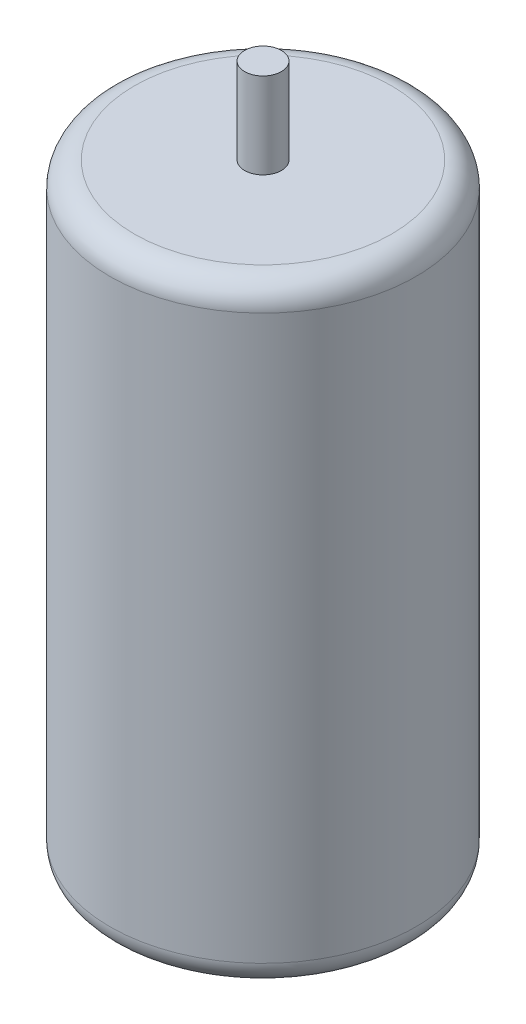
ISO-10303-21;
HEADER;
FILE_DESCRIPTION(('STEP AP214'),'2;1');
FILE_NAME('part.step','',(''),(''),'','','');
FILE_SCHEMA(('AUTOMOTIVE_DESIGN { 1 0 10303 214 1 1 1 1 }'));
ENDSEC;
DATA;
#1=APPLICATION_CONTEXT('core data for automotive mechanical design processes');
#2=APPLICATION_PROTOCOL_DEFINITION('international standard','automotive_design',2000,#1);
#3=PRODUCT_CONTEXT('',#1,'mechanical');
#4=PRODUCT('Part','Part','',(#3));
#5=PRODUCT_RELATED_PRODUCT_CATEGORY('part','',(#4));
#6=PRODUCT_DEFINITION_FORMATION('','',#4);
#7=PRODUCT_DEFINITION_CONTEXT('part definition',#1,'design');
#8=PRODUCT_DEFINITION('design','',#6,#7);
#9=PRODUCT_DEFINITION_SHAPE('','',#8);
#10=(LENGTH_UNIT() NAMED_UNIT(*) SI_UNIT(.MILLI.,.METRE.));
#11=(NAMED_UNIT(*) PLANE_ANGLE_UNIT() SI_UNIT($,.RADIAN.));
#12=(NAMED_UNIT(*) SI_UNIT($,.STERADIAN.) SOLID_ANGLE_UNIT());
#13=UNCERTAINTY_MEASURE_WITH_UNIT(LENGTH_MEASURE(1.E-05),#10,'distance_accuracy_value','');
#14=(GEOMETRIC_REPRESENTATION_CONTEXT(3) GLOBAL_UNCERTAINTY_ASSIGNED_CONTEXT((#13)) GLOBAL_UNIT_ASSIGNED_CONTEXT((#10,
#11,#12)) REPRESENTATION_CONTEXT('',''));
#15=CARTESIAN_POINT('',(0.,0.,0.));
#16=DIRECTION('',(0.,0.,1.));
#17=DIRECTION('',(1.,0.,0.));
#18=AXIS2_PLACEMENT_3D('',#15,#16,#17);
#19=CARTESIAN_POINT('',(0.,0.,0.));
#20=DIRECTION('',(0.,1.,0.));
#21=DIRECTION('',(0.,0.,1.));
#22=AXIS2_PLACEMENT_3D('',#19,#20,#21);
#23=PLANE('',#22);
#24=CARTESIAN_POINT('',(0.,0.,0.));
#25=DIRECTION('',(0.,1.,0.));
#26=DIRECTION('',(0.,0.,1.));
#27=AXIS2_PLACEMENT_3D('',#24,#25,#26);
#28=CIRCLE('',#27,10.5);
#29=CARTESIAN_POINT('',(0.,0.,10.5));
#30=VERTEX_POINT('',#29);
#31=EDGE_CURVE('E179',#30,#30,#28,.F.);
#32=ORIENTED_EDGE('',*,*,#31,.T.);
#33=EDGE_LOOP('',(#32));
#34=FACE_BOUND('',#33,.T.);
#35=DIRECTION('',(-1.,0.,0.));
#36=VECTOR('',#35,1.);
#37=CARTESIAN_POINT('',(0.,0.,-1.48182210592521));
#38=LINE('',#37,#36);
#39=CARTESIAN_POINT('',(-4.53628046033347,0.,-1.48182210592521));
#40=VERTEX_POINT('',#39);
#41=CARTESIAN_POINT('',(-5.46863849961149,0.,-1.48182210592521));
#42=VERTEX_POINT('',#41);
#43=EDGE_CURVE('E150',#40,#42,#38,.T.);
#44=ORIENTED_EDGE('',*,*,#43,.T.);
#45=DIRECTION('',(0.,0.,1.));
#46=VECTOR('',#45,1.);
#47=CARTESIAN_POINT('',(-5.46863849961149,0.,0.));
#48=LINE('',#47,#46);
#49=CARTESIAN_POINT('',(-5.46863849961149,0.,1.48182210592521));
#50=VERTEX_POINT('',#49);
#51=EDGE_CURVE('E123',#42,#50,#48,.T.);
#52=ORIENTED_EDGE('',*,*,#51,.T.);
#53=DIRECTION('',(-1.,0.,0.));
#54=VECTOR('',#53,1.);
#55=CARTESIAN_POINT('',(0.,0.,1.48182210592521));
#56=LINE('',#55,#54);
#57=CARTESIAN_POINT('',(-4.53628046033347,0.,1.48182210592521));
#58=VERTEX_POINT('',#57);
#59=EDGE_CURVE('E156',#58,#50,#56,.T.);
#60=ORIENTED_EDGE('',*,*,#59,.F.);
#61=DIRECTION('',(0.,0.,1.));
#62=VECTOR('',#61,1.);
#63=CARTESIAN_POINT('',(-4.53628046033347,0.,0.));
#64=LINE('',#63,#62);
#65=EDGE_CURVE('E153',#40,#58,#64,.T.);
#66=ORIENTED_EDGE('',*,*,#65,.F.);
#67=EDGE_LOOP('',(#44,#52,#60,#66));
#68=FACE_BOUND('',#67,.T.);
#69=DIRECTION('',(1.,0.,0.));
#70=VECTOR('',#69,1.);
#71=CARTESIAN_POINT('',(0.,0.,-1.48182210592521));
#72=LINE('',#71,#70);
#73=CARTESIAN_POINT('',(4.53628046033347,0.,-1.48182210592521));
#74=VERTEX_POINT('',#73);
#75=CARTESIAN_POINT('',(5.46863849961149,0.,-1.48182210592521));
#76=VERTEX_POINT('',#75);
#77=EDGE_CURVE('E127',#74,#76,#72,.T.);
#78=ORIENTED_EDGE('',*,*,#77,.F.);
#79=DIRECTION('',(0.,0.,1.));
#80=VECTOR('',#79,1.);
#81=CARTESIAN_POINT('',(4.53628046033347,0.,0.));
#82=LINE('',#81,#80);
#83=CARTESIAN_POINT('',(4.53628046033347,0.,1.48182210592521));
#84=VERTEX_POINT('',#83);
#85=EDGE_CURVE('E139',#74,#84,#82,.T.);
#86=ORIENTED_EDGE('',*,*,#85,.T.);
#87=DIRECTION('',(1.,0.,0.));
#88=VECTOR('',#87,1.);
#89=CARTESIAN_POINT('',(0.,0.,1.48182210592521));
#90=LINE('',#89,#88);
#91=CARTESIAN_POINT('',(5.46863849961149,0.,1.48182210592521));
#92=VERTEX_POINT('',#91);
#93=EDGE_CURVE('E137',#84,#92,#90,.T.);
#94=ORIENTED_EDGE('',*,*,#93,.T.);
#95=DIRECTION('',(0.,0.,1.));
#96=VECTOR('',#95,1.);
#97=CARTESIAN_POINT('',(5.46863849961149,0.,0.));
#98=LINE('',#97,#96);
#99=EDGE_CURVE('E116',#76,#92,#98,.T.);
#100=ORIENTED_EDGE('',*,*,#99,.F.);
#101=EDGE_LOOP('',(#78,#86,#94,#100));
#102=FACE_BOUND('',#101,.T.);
#103=ADVANCED_FACE('F36',(#34,#68,#102),#23,.F.);
#104=CARTESIAN_POINT('',(0.,50.,0.));
#105=DIRECTION('',(0.,-1.,0.));
#106=DIRECTION('',(0.,0.,-1.));
#107=AXIS2_PLACEMENT_3D('',#104,#105,#106);
#108=CYLINDRICAL_SURFACE('',#107,12.5);
#109=CARTESIAN_POINT('',(0.,2.,0.));
#110=DIRECTION('',(0.,1.,0.));
#111=DIRECTION('',(0.,0.,1.));
#112=AXIS2_PLACEMENT_3D('',#109,#110,#111);
#113=CIRCLE('',#112,12.5);
#114=CARTESIAN_POINT('',(0.,2.,12.5));
#115=VERTEX_POINT('',#114);
#116=EDGE_CURVE('E176',#115,#115,#113,.T.);
#117=ORIENTED_EDGE('',*,*,#116,.T.);
#118=EDGE_LOOP('',(#117));
#119=FACE_BOUND('',#118,.T.);
#120=CARTESIAN_POINT('',(0.,48.,0.));
#121=DIRECTION('',(0.,1.,0.));
#122=DIRECTION('',(0.,0.,1.));
#123=AXIS2_PLACEMENT_3D('',#120,#121,#122);
#124=CIRCLE('',#123,12.5);
#125=CARTESIAN_POINT('',(0.,48.,12.5));
#126=VERTEX_POINT('',#125);
#127=EDGE_CURVE('E171',#126,#126,#124,.F.);
#128=ORIENTED_EDGE('',*,*,#127,.T.);
#129=EDGE_LOOP('',(#128));
#130=FACE_BOUND('',#129,.T.);
#131=ADVANCED_FACE('F254',(#119,#130),#108,.T.);
#132=CARTESIAN_POINT('',(0.,50.,0.));
#133=DIRECTION('',(0.,1.,0.));
#134=DIRECTION('',(0.,0.,1.));
#135=AXIS2_PLACEMENT_3D('',#132,#133,#134);
#136=PLANE('',#135);
#137=CARTESIAN_POINT('',(0.,50.,0.));
#138=DIRECTION('',(0.,1.,0.));
#139=DIRECTION('',(0.,0.,1.));
#140=AXIS2_PLACEMENT_3D('',#137,#138,#139);
#141=CIRCLE('',#140,1.5);
#142=CARTESIAN_POINT('',(0.,50.,1.5));
#143=VERTEX_POINT('',#142);
#144=EDGE_CURVE('E167',#143,#143,#141,.T.);
#145=ORIENTED_EDGE('',*,*,#144,.F.);
#146=EDGE_LOOP('',(#145));
#147=FACE_BOUND('',#146,.T.);
#148=CARTESIAN_POINT('',(0.,50.,0.));
#149=DIRECTION('',(0.,1.,0.));
#150=DIRECTION('',(0.,0.,1.));
#151=AXIS2_PLACEMENT_3D('',#148,#149,#150);
#152=CIRCLE('',#151,10.5);
#153=CARTESIAN_POINT('',(0.,50.,10.5));
#154=VERTEX_POINT('',#153);
#155=EDGE_CURVE('E182',#154,#154,#152,.T.);
#156=ORIENTED_EDGE('',*,*,#155,.T.);
#157=EDGE_LOOP('',(#156));
#158=FACE_BOUND('',#157,.T.);
#159=ADVANCED_FACE('F260',(#147,#158),#136,.T.);
#160=CARTESIAN_POINT('',(0.,2.,0.));
#161=DIRECTION('',(0.,1.,0.));
#162=DIRECTION('',(0.,0.,1.));
#163=AXIS2_PLACEMENT_3D('',#160,#161,#162);
#164=TOROIDAL_SURFACE('',#163,10.5,2.);
#165=ORIENTED_EDGE('',*,*,#31,.F.);
#166=EDGE_LOOP('',(#165));
#167=FACE_BOUND('',#166,.T.);
#168=ORIENTED_EDGE('',*,*,#116,.F.);
#169=EDGE_LOOP('',(#168));
#170=FACE_BOUND('',#169,.T.);
#171=ADVANCED_FACE('F267',(#167,#170),#164,.T.);
#172=CARTESIAN_POINT('',(0.,48.,0.));
#173=DIRECTION('',(0.,1.,0.));
#174=DIRECTION('',(0.,0.,1.));
#175=AXIS2_PLACEMENT_3D('',#172,#173,#174);
#176=TOROIDAL_SURFACE('',#175,10.5,2.);
#177=ORIENTED_EDGE('',*,*,#127,.F.);
#178=EDGE_LOOP('',(#177));
#179=FACE_BOUND('',#178,.T.);
#180=ORIENTED_EDGE('',*,*,#155,.F.);
#181=EDGE_LOOP('',(#180));
#182=FACE_BOUND('',#181,.T.);
#183=ADVANCED_FACE('F269',(#179,#182),#176,.T.);
#184=CARTESIAN_POINT('',(0.,57.,0.));
#185=DIRECTION('',(0.,-1.,0.));
#186=DIRECTION('',(0.,0.,-1.));
#187=AXIS2_PLACEMENT_3D('',#184,#185,#186);
#188=CYLINDRICAL_SURFACE('',#187,1.5);
#189=CARTESIAN_POINT('',(0.,57.,0.));
#190=DIRECTION('',(0.,1.,0.));
#191=DIRECTION('',(0.,0.,1.));
#192=AXIS2_PLACEMENT_3D('',#189,#190,#191);
#193=CIRCLE('',#192,1.5);
#194=CARTESIAN_POINT('',(0.,57.,1.5));
#195=VERTEX_POINT('',#194);
#196=EDGE_CURVE('E168',#195,#195,#193,.T.);
#197=ORIENTED_EDGE('',*,*,#196,.F.);
#198=EDGE_LOOP('',(#197));
#199=FACE_BOUND('',#198,.T.);
#200=ORIENTED_EDGE('',*,*,#144,.T.);
#201=EDGE_LOOP('',(#200));
#202=FACE_BOUND('',#201,.T.);
#203=ADVANCED_FACE('F272',(#199,#202),#188,.T.);
#204=CARTESIAN_POINT('',(0.,57.,0.));
#205=DIRECTION('',(0.,1.,0.));
#206=DIRECTION('',(0.,0.,1.));
#207=AXIS2_PLACEMENT_3D('',#204,#205,#206);
#208=PLANE('',#207);
#209=ORIENTED_EDGE('',*,*,#196,.T.);
#210=EDGE_LOOP('',(#209));
#211=FACE_BOUND('',#210,.T.);
#212=ADVANCED_FACE('F277',(#211),#208,.T.);
#213=CARTESIAN_POINT('',(-5.46863849961149,-4.,0.));
#214=DIRECTION('',(-1.,0.,0.));
#215=DIRECTION('',(0.,0.,1.));
#216=AXIS2_PLACEMENT_3D('',#213,#214,#215);
#217=PLANE('',#216);
#218=CARTESIAN_POINT('',(-5.46863849961149,-2.,0.));
#219=DIRECTION('',(-1.,0.,0.));
#220=DIRECTION('',(0.,0.,1.));
#221=AXIS2_PLACEMENT_3D('',#218,#219,#220);
#222=CIRCLE('',#221,0.814443909301504);
#223=CARTESIAN_POINT('',(-5.46863849961149,-2.,0.814443909301504));
#224=VERTEX_POINT('',#223);
#225=EDGE_CURVE('E208',#224,#224,#222,.T.);
#226=ORIENTED_EDGE('',*,*,#225,.F.);
#227=EDGE_LOOP('',(#226));
#228=FACE_BOUND('',#227,.T.);
#229=CARTESIAN_POINT('',(-5.46863849961149,-2.,0.51817789407479));
#230=DIRECTION('',(-1.,0.,0.));
#231=DIRECTION('',(0.,0.,1.));
#232=AXIS2_PLACEMENT_3D('',#229,#230,#231);
#233=CIRCLE('',#232,2.);
#234=CARTESIAN_POINT('',(-5.46863849961149,-2.,-1.48182210592521));
#235=VERTEX_POINT('',#234);
#236=CARTESIAN_POINT('',(-5.46863849961149,-3.93170693172961,0.));
#237=VERTEX_POINT('',#236);
#238=EDGE_CURVE('E196',#235,#237,#233,.T.);
#239=ORIENTED_EDGE('',*,*,#238,.T.);
#240=CARTESIAN_POINT('',(-5.46863849961149,-2.,-0.51817789407479));
#241=DIRECTION('',(-1.,0.,0.));
#242=DIRECTION('',(0.,0.,1.));
#243=AXIS2_PLACEMENT_3D('',#240,#241,#242);
#244=CIRCLE('',#243,2.);
#245=CARTESIAN_POINT('',(-5.46863849961149,-2.,1.48182210592521));
#246=VERTEX_POINT('',#245);
#247=EDGE_CURVE('E198',#237,#246,#244,.T.);
#248=ORIENTED_EDGE('',*,*,#247,.T.);
#249=DIRECTION('',(0.,1.,0.));
#250=VECTOR('',#249,1.);
#251=CARTESIAN_POINT('',(-5.46863849961149,-4.,1.48182210592521));
#252=LINE('',#251,#250);
#253=EDGE_CURVE('E159',#246,#50,#252,.T.);
#254=ORIENTED_EDGE('',*,*,#253,.T.);
#255=ORIENTED_EDGE('',*,*,#51,.F.);
#256=DIRECTION('',(0.,1.,0.));
#257=VECTOR('',#256,1.);
#258=CARTESIAN_POINT('',(-5.46863849961149,-4.,-1.48182210592521));
#259=LINE('',#258,#257);
#260=EDGE_CURVE('E165',#235,#42,#259,.T.);
#261=ORIENTED_EDGE('',*,*,#260,.F.);
#262=EDGE_LOOP('',(#239,#248,#254,#255,#261));
#263=FACE_BOUND('',#262,.T.);
#264=ADVANCED_FACE('F316',(#228,#263),#217,.T.);
#265=CARTESIAN_POINT('',(0.,-4.,-1.48182210592521));
#266=DIRECTION('',(0.,0.,-1.));
#267=DIRECTION('',(-1.,0.,0.));
#268=AXIS2_PLACEMENT_3D('',#265,#266,#267);
#269=PLANE('',#268);
#270=DIRECTION('',(0.,1.,0.));
#271=VECTOR('',#270,1.);
#272=CARTESIAN_POINT('',(-4.53628046033347,-4.,-1.48182210592521));
#273=LINE('',#272,#271);
#274=CARTESIAN_POINT('',(-4.53628046033347,-2.,-1.48182210592521));
#275=VERTEX_POINT('',#274);
#276=EDGE_CURVE('E163',#275,#40,#273,.T.);
#277=ORIENTED_EDGE('',*,*,#276,.F.);
#278=DIRECTION('',(-1.,0.,0.));
#279=VECTOR('',#278,1.);
#280=CARTESIAN_POINT('',(0.,-2.,-1.48182210592521));
#281=LINE('',#280,#279);
#282=EDGE_CURVE('E11',#275,#235,#281,.T.);
#283=ORIENTED_EDGE('',*,*,#282,.T.);
#284=ORIENTED_EDGE('',*,*,#260,.T.);
#285=ORIENTED_EDGE('',*,*,#43,.F.);
#286=EDGE_LOOP('',(#277,#283,#284,#285));
#287=FACE_BOUND('',#286,.T.);
#288=ADVANCED_FACE('F330',(#287),#269,.T.);
#289=CARTESIAN_POINT('',(-4.53628046033347,-4.,0.));
#290=DIRECTION('',(-1.,0.,0.));
#291=DIRECTION('',(0.,0.,1.));
#292=AXIS2_PLACEMENT_3D('',#289,#290,#291);
#293=PLANE('',#292);
#294=CARTESIAN_POINT('',(-4.53628046033347,-2.,0.));
#295=DIRECTION('',(-1.,0.,0.));
#296=DIRECTION('',(0.,0.,1.));
#297=AXIS2_PLACEMENT_3D('',#294,#295,#296);
#298=CIRCLE('',#297,0.814443909301504);
#299=CARTESIAN_POINT('',(-4.53628046033347,-2.,0.814443909301504));
#300=VERTEX_POINT('',#299);
#301=EDGE_CURVE('E213',#300,#300,#298,.T.);
#302=ORIENTED_EDGE('',*,*,#301,.T.);
#303=EDGE_LOOP('',(#302));
#304=FACE_BOUND('',#303,.T.);
#305=DIRECTION('',(0.,1.,0.));
#306=VECTOR('',#305,1.);
#307=CARTESIAN_POINT('',(-4.53628046033347,-4.,1.48182210592521));
#308=LINE('',#307,#306);
#309=CARTESIAN_POINT('',(-4.53628046033347,-2.,1.48182210592521));
#310=VERTEX_POINT('',#309);
#311=EDGE_CURVE('E161',#310,#58,#308,.T.);
#312=ORIENTED_EDGE('',*,*,#311,.F.);
#313=CARTESIAN_POINT('',(-4.53628046033347,-2.,-0.51817789407479));
#314=DIRECTION('',(-1.,0.,0.));
#315=DIRECTION('',(0.,0.,1.));
#316=AXIS2_PLACEMENT_3D('',#313,#314,#315);
#317=CIRCLE('',#316,2.);
#318=CARTESIAN_POINT('',(-4.53628046033347,-3.93170693172961,0.));
#319=VERTEX_POINT('',#318);
#320=EDGE_CURVE('E45',#310,#319,#317,.F.);
#321=ORIENTED_EDGE('',*,*,#320,.T.);
#322=CARTESIAN_POINT('',(-4.53628046033347,-2.,0.51817789407479));
#323=DIRECTION('',(-1.,0.,0.));
#324=DIRECTION('',(0.,0.,1.));
#325=AXIS2_PLACEMENT_3D('',#322,#323,#324);
#326=CIRCLE('',#325,2.);
#327=EDGE_CURVE('E56',#319,#275,#326,.F.);
#328=ORIENTED_EDGE('',*,*,#327,.T.);
#329=ORIENTED_EDGE('',*,*,#276,.T.);
#330=ORIENTED_EDGE('',*,*,#65,.T.);
#331=EDGE_LOOP('',(#312,#321,#328,#329,#330));
#332=FACE_BOUND('',#331,.T.);
#333=ADVANCED_FACE('F340',(#304,#332),#293,.F.);
#334=CARTESIAN_POINT('',(0.,-4.,1.48182210592521));
#335=DIRECTION('',(0.,0.,-1.));
#336=DIRECTION('',(-1.,0.,0.));
#337=AXIS2_PLACEMENT_3D('',#334,#335,#336);
#338=PLANE('',#337);
#339=ORIENTED_EDGE('',*,*,#253,.F.);
#340=DIRECTION('',(-1.,0.,0.));
#341=VECTOR('',#340,1.);
#342=CARTESIAN_POINT('',(-4.53628046033347,-2.,1.48182210592521));
#343=LINE('',#342,#341);
#344=EDGE_CURVE('E200',#246,#310,#343,.F.);
#345=ORIENTED_EDGE('',*,*,#344,.T.);
#346=ORIENTED_EDGE('',*,*,#311,.T.);
#347=ORIENTED_EDGE('',*,*,#59,.T.);
#348=EDGE_LOOP('',(#339,#345,#346,#347));
#349=FACE_BOUND('',#348,.T.);
#350=ADVANCED_FACE('F349',(#349),#338,.F.);
#351=CARTESIAN_POINT('',(0.,-4.,-1.48182210592521));
#352=DIRECTION('',(0.,0.,1.));
#353=DIRECTION('',(1.,0.,0.));
#354=AXIS2_PLACEMENT_3D('',#351,#352,#353);
#355=PLANE('',#354);
#356=DIRECTION('',(0.,1.,0.));
#357=VECTOR('',#356,1.);
#358=CARTESIAN_POINT('',(5.46863849961149,-4.,-1.48182210592521));
#359=LINE('',#358,#357);
#360=CARTESIAN_POINT('',(5.46863849961149,-2.,-1.48182210592521));
#361=VERTEX_POINT('',#360);
#362=EDGE_CURVE('E111',#361,#76,#359,.T.);
#363=ORIENTED_EDGE('',*,*,#362,.F.);
#364=DIRECTION('',(1.,0.,0.));
#365=VECTOR('',#364,1.);
#366=CARTESIAN_POINT('',(4.53628046033347,-2.,-1.48182210592521));
#367=LINE('',#366,#365);
#368=CARTESIAN_POINT('',(4.53628046033347,-2.,-1.48182210592521));
#369=VERTEX_POINT('',#368);
#370=EDGE_CURVE('E188',#361,#369,#367,.F.);
#371=ORIENTED_EDGE('',*,*,#370,.T.);
#372=DIRECTION('',(0.,1.,0.));
#373=VECTOR('',#372,1.);
#374=CARTESIAN_POINT('',(4.53628046033347,-4.,-1.48182210592521));
#375=LINE('',#374,#373);
#376=EDGE_CURVE('E130',#369,#74,#375,.T.);
#377=ORIENTED_EDGE('',*,*,#376,.T.);
#378=ORIENTED_EDGE('',*,*,#77,.T.);
#379=EDGE_LOOP('',(#363,#371,#377,#378));
#380=FACE_BOUND('',#379,.T.);
#381=ADVANCED_FACE('F128',(#380),#355,.F.);
#382=CARTESIAN_POINT('',(5.46863849961149,-4.,0.));
#383=DIRECTION('',(-1.,0.,0.));
#384=DIRECTION('',(0.,0.,1.));
#385=AXIS2_PLACEMENT_3D('',#382,#383,#384);
#386=PLANE('',#385);
#387=CARTESIAN_POINT('',(5.46863849961149,-2.,0.));
#388=DIRECTION('',(1.,0.,0.));
#389=DIRECTION('',(0.,0.,-1.));
#390=AXIS2_PLACEMENT_3D('',#387,#388,#389);
#391=CIRCLE('',#390,0.814443909301504);
#392=CARTESIAN_POINT('',(5.46863849961149,-2.,-0.814443909301504));
#393=VERTEX_POINT('',#392);
#394=EDGE_CURVE('E219',#393,#393,#391,.T.);
#395=ORIENTED_EDGE('',*,*,#394,.F.);
#396=EDGE_LOOP('',(#395));
#397=FACE_BOUND('',#396,.T.);
#398=CARTESIAN_POINT('',(5.46863849961149,-2.,-0.51817789407479));
#399=DIRECTION('',(-1.,0.,0.));
#400=DIRECTION('',(0.,0.,1.));
#401=AXIS2_PLACEMENT_3D('',#398,#399,#400);
#402=CIRCLE('',#401,2.);
#403=CARTESIAN_POINT('',(5.46863849961149,-2.,1.48182210592521));
#404=VERTEX_POINT('',#403);
#405=CARTESIAN_POINT('',(5.46863849961149,-3.93170693172961,0.));
#406=VERTEX_POINT('',#405);
#407=EDGE_CURVE('E185',#404,#406,#402,.F.);
#408=ORIENTED_EDGE('',*,*,#407,.T.);
#409=CARTESIAN_POINT('',(5.46863849961149,-2.,0.51817789407479));
#410=DIRECTION('',(-1.,0.,0.));
#411=DIRECTION('',(0.,0.,1.));
#412=AXIS2_PLACEMENT_3D('',#409,#410,#411);
#413=CIRCLE('',#412,2.);
#414=EDGE_CURVE('E119',#406,#361,#413,.F.);
#415=ORIENTED_EDGE('',*,*,#414,.T.);
#416=ORIENTED_EDGE('',*,*,#362,.T.);
#417=ORIENTED_EDGE('',*,*,#99,.T.);
#418=DIRECTION('',(0.,1.,0.));
#419=VECTOR('',#418,1.);
#420=CARTESIAN_POINT('',(5.46863849961149,-4.,1.48182210592521));
#421=LINE('',#420,#419);
#422=EDGE_CURVE('E124',#404,#92,#421,.T.);
#423=ORIENTED_EDGE('',*,*,#422,.F.);
#424=EDGE_LOOP('',(#408,#415,#416,#417,#423));
#425=FACE_BOUND('',#424,.T.);
#426=ADVANCED_FACE('F113',(#397,#425),#386,.F.);
#427=CARTESIAN_POINT('',(0.,-4.,1.48182210592521));
#428=DIRECTION('',(0.,0.,1.));
#429=DIRECTION('',(1.,0.,0.));
#430=AXIS2_PLACEMENT_3D('',#427,#428,#429);
#431=PLANE('',#430);
#432=DIRECTION('',(0.,1.,0.));
#433=VECTOR('',#432,1.);
#434=CARTESIAN_POINT('',(4.53628046033347,-4.,1.48182210592521));
#435=LINE('',#434,#433);
#436=CARTESIAN_POINT('',(4.53628046033347,-2.,1.48182210592521));
#437=VERTEX_POINT('',#436);
#438=EDGE_CURVE('E145',#437,#84,#435,.T.);
#439=ORIENTED_EDGE('',*,*,#438,.F.);
#440=DIRECTION('',(1.,0.,0.));
#441=VECTOR('',#440,1.);
#442=CARTESIAN_POINT('',(0.,-2.,1.48182210592521));
#443=LINE('',#442,#441);
#444=EDGE_CURVE('E194',#437,#404,#443,.T.);
#445=ORIENTED_EDGE('',*,*,#444,.T.);
#446=ORIENTED_EDGE('',*,*,#422,.T.);
#447=ORIENTED_EDGE('',*,*,#93,.F.);
#448=EDGE_LOOP('',(#439,#445,#446,#447));
#449=FACE_BOUND('',#448,.T.);
#450=ADVANCED_FACE('F232',(#449),#431,.T.);
#451=CARTESIAN_POINT('',(4.53628046033347,-4.,0.));
#452=DIRECTION('',(-1.,0.,0.));
#453=DIRECTION('',(0.,0.,1.));
#454=AXIS2_PLACEMENT_3D('',#451,#452,#453);
#455=PLANE('',#454);
#456=CARTESIAN_POINT('',(4.53628046033347,-2.,0.));
#457=DIRECTION('',(-1.,0.,0.));
#458=DIRECTION('',(0.,0.,1.));
#459=AXIS2_PLACEMENT_3D('',#456,#457,#458);
#460=CIRCLE('',#459,0.814443909301504);
#461=CARTESIAN_POINT('',(4.53628046033347,-2.,0.814443909301504));
#462=VERTEX_POINT('',#461);
#463=EDGE_CURVE('E40',#462,#462,#460,.T.);
#464=ORIENTED_EDGE('',*,*,#463,.F.);
#465=EDGE_LOOP('',(#464));
#466=FACE_BOUND('',#465,.T.);
#467=ORIENTED_EDGE('',*,*,#376,.F.);
#468=CARTESIAN_POINT('',(4.53628046033347,-2.,0.51817789407479));
#469=DIRECTION('',(-1.,0.,0.));
#470=DIRECTION('',(0.,0.,1.));
#471=AXIS2_PLACEMENT_3D('',#468,#469,#470);
#472=CIRCLE('',#471,2.);
#473=CARTESIAN_POINT('',(4.53628046033347,-3.93170693172961,0.));
#474=VERTEX_POINT('',#473);
#475=EDGE_CURVE('E192',#369,#474,#472,.T.);
#476=ORIENTED_EDGE('',*,*,#475,.T.);
#477=CARTESIAN_POINT('',(4.53628046033347,-2.,-0.51817789407479));
#478=DIRECTION('',(-1.,0.,0.));
#479=DIRECTION('',(0.,0.,1.));
#480=AXIS2_PLACEMENT_3D('',#477,#478,#479);
#481=CIRCLE('',#480,2.);
#482=EDGE_CURVE('E190',#474,#437,#481,.T.);
#483=ORIENTED_EDGE('',*,*,#482,.T.);
#484=ORIENTED_EDGE('',*,*,#438,.T.);
#485=ORIENTED_EDGE('',*,*,#85,.F.);
#486=EDGE_LOOP('',(#467,#476,#483,#484,#485));
#487=FACE_BOUND('',#486,.T.);
#488=ADVANCED_FACE('F228',(#466,#487),#455,.T.);
#489=CARTESIAN_POINT('',(0.,-2.,-0.51817789407479));
#490=DIRECTION('',(1.,0.,0.));
#491=DIRECTION('',(0.,0.,-1.));
#492=AXIS2_PLACEMENT_3D('',#489,#490,#491);
#493=CYLINDRICAL_SURFACE('',#492,2.);
#494=ORIENTED_EDGE('',*,*,#444,.F.);
#495=ORIENTED_EDGE('',*,*,#482,.F.);
#496=DIRECTION('',(1.,0.,0.));
#497=VECTOR('',#496,1.);
#498=CARTESIAN_POINT('',(5.00245947997248,-3.93170693172961,0.));
#499=LINE('',#498,#497);
#500=EDGE_CURVE('E134',#406,#474,#499,.F.);
#501=ORIENTED_EDGE('',*,*,#500,.F.);
#502=ORIENTED_EDGE('',*,*,#407,.F.);
#503=EDGE_LOOP('',(#494,#495,#501,#502));
#504=FACE_BOUND('',#503,.T.);
#505=ADVANCED_FACE('F231',(#504),#493,.T.);
#506=CARTESIAN_POINT('',(0.,-2.,0.51817789407479));
#507=DIRECTION('',(-1.,0.,0.));
#508=DIRECTION('',(0.,0.,1.));
#509=AXIS2_PLACEMENT_3D('',#506,#507,#508);
#510=CYLINDRICAL_SURFACE('',#509,2.);
#511=ORIENTED_EDGE('',*,*,#475,.F.);
#512=ORIENTED_EDGE('',*,*,#370,.F.);
#513=ORIENTED_EDGE('',*,*,#414,.F.);
#514=ORIENTED_EDGE('',*,*,#500,.T.);
#515=EDGE_LOOP('',(#511,#512,#513,#514));
#516=FACE_BOUND('',#515,.T.);
#517=ADVANCED_FACE('F242',(#516),#510,.T.);
#518=CARTESIAN_POINT('',(0.,-2.,0.51817789407479));
#519=DIRECTION('',(-1.,0.,0.));
#520=DIRECTION('',(0.,0.,1.));
#521=AXIS2_PLACEMENT_3D('',#518,#519,#520);
#522=CYLINDRICAL_SURFACE('',#521,2.);
#523=ORIENTED_EDGE('',*,*,#282,.F.);
#524=ORIENTED_EDGE('',*,*,#327,.F.);
#525=DIRECTION('',(-1.,0.,0.));
#526=VECTOR('',#525,1.);
#527=CARTESIAN_POINT('',(-5.00245947997248,-3.93170693172961,0.));
#528=LINE('',#527,#526);
#529=EDGE_CURVE('E206',#237,#319,#528,.F.);
#530=ORIENTED_EDGE('',*,*,#529,.F.);
#531=ORIENTED_EDGE('',*,*,#238,.F.);
#532=EDGE_LOOP('',(#523,#524,#530,#531));
#533=FACE_BOUND('',#532,.T.);
#534=ADVANCED_FACE('F38',(#533),#522,.T.);
#535=CARTESIAN_POINT('',(0.,-2.,-0.51817789407479));
#536=DIRECTION('',(1.,0.,0.));
#537=DIRECTION('',(0.,0.,-1.));
#538=AXIS2_PLACEMENT_3D('',#535,#536,#537);
#539=CYLINDRICAL_SURFACE('',#538,2.);
#540=ORIENTED_EDGE('',*,*,#320,.F.);
#541=ORIENTED_EDGE('',*,*,#344,.F.);
#542=ORIENTED_EDGE('',*,*,#247,.F.);
#543=ORIENTED_EDGE('',*,*,#529,.T.);
#544=EDGE_LOOP('',(#540,#541,#542,#543));
#545=FACE_BOUND('',#544,.T.);
#546=ADVANCED_FACE('F249',(#545),#539,.T.);
#547=CARTESIAN_POINT('',(-12.5313615003885,-2.,0.));
#548=DIRECTION('',(1.,0.,0.));
#549=DIRECTION('',(0.,0.,-1.));
#550=AXIS2_PLACEMENT_3D('',#547,#548,#549);
#551=CYLINDRICAL_SURFACE('',#550,0.814443909301504);
#552=ORIENTED_EDGE('',*,*,#463,.T.);
#553=EDGE_LOOP('',(#552));
#554=FACE_BOUND('',#553,.T.);
#555=ORIENTED_EDGE('',*,*,#394,.T.);
#556=EDGE_LOOP('',(#555));
#557=FACE_BOUND('',#556,.T.);
#558=ADVANCED_FACE('F226',(#554,#557),#551,.F.);
#559=ORIENTED_EDGE('',*,*,#225,.T.);
#560=EDGE_LOOP('',(#559));
#561=FACE_BOUND('',#560,.T.);
#562=ORIENTED_EDGE('',*,*,#301,.F.);
#563=EDGE_LOOP('',(#562));
#564=FACE_BOUND('',#563,.T.);
#565=ADVANCED_FACE('F411',(#561,#564),#551,.F.);
#566=CLOSED_SHELL('',(#103,#131,#159,#171,#183,#203,#212,#264,#288,#333,#350,#381,#426,#450,
#488,#505,#517,#534,#546,#558,#565));
#567=MANIFOLD_SOLID_BREP('B2',#566);
#568=ADVANCED_BREP_SHAPE_REPRESENTATION('',(#18,#567),#14);
#569=SHAPE_DEFINITION_REPRESENTATION(#9,#568);
ENDSEC;
END-ISO-10303-21;
